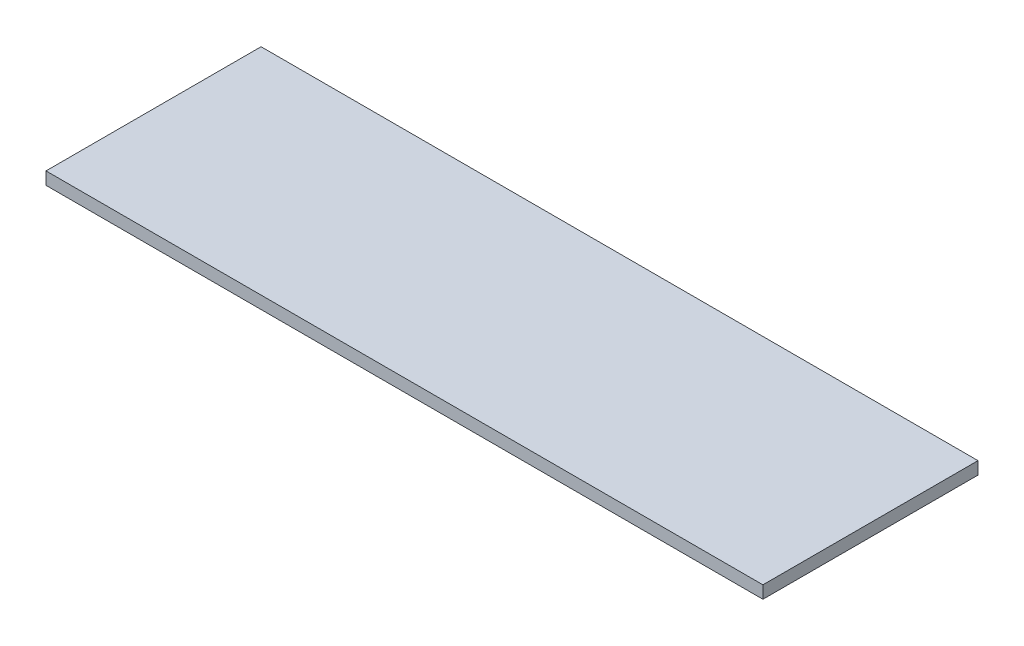
ISO-10303-21;
HEADER;
FILE_DESCRIPTION(('STEP AP214'),'2;1');
FILE_NAME('part.step','',(''),(''),'','','');
FILE_SCHEMA(('AUTOMOTIVE_DESIGN { 1 0 10303 214 1 1 1 1 }'));
ENDSEC;
DATA;
#1=APPLICATION_CONTEXT('core data for automotive mechanical design processes');
#2=APPLICATION_PROTOCOL_DEFINITION('international standard','automotive_design',2000,#1);
#3=PRODUCT_CONTEXT('',#1,'mechanical');
#4=PRODUCT('Part','Part','',(#3));
#5=PRODUCT_RELATED_PRODUCT_CATEGORY('part','',(#4));
#6=PRODUCT_DEFINITION_FORMATION('','',#4);
#7=PRODUCT_DEFINITION_CONTEXT('part definition',#1,'design');
#8=PRODUCT_DEFINITION('design','',#6,#7);
#9=PRODUCT_DEFINITION_SHAPE('','',#8);
#10=(LENGTH_UNIT() NAMED_UNIT(*) SI_UNIT(.MILLI.,.METRE.));
#11=(NAMED_UNIT(*) PLANE_ANGLE_UNIT() SI_UNIT($,.RADIAN.));
#12=(NAMED_UNIT(*) SI_UNIT($,.STERADIAN.) SOLID_ANGLE_UNIT());
#13=UNCERTAINTY_MEASURE_WITH_UNIT(LENGTH_MEASURE(1.E-05),#10,'distance_accuracy_value','');
#14=(GEOMETRIC_REPRESENTATION_CONTEXT(3) GLOBAL_UNCERTAINTY_ASSIGNED_CONTEXT((#13)) GLOBAL_UNIT_ASSIGNED_CONTEXT((#10,
#11,#12)) REPRESENTATION_CONTEXT('',''));
#15=CARTESIAN_POINT('',(0.,0.,0.));
#16=DIRECTION('',(0.,0.,1.));
#17=DIRECTION('',(1.,0.,0.));
#18=AXIS2_PLACEMENT_3D('',#15,#16,#17);
#19=CARTESIAN_POINT('',(1006.1249067144,35.,-358.016168426969));
#20=DIRECTION('',(-1.,0.,0.));
#21=DIRECTION('',(0.,0.,1.));
#22=AXIS2_PLACEMENT_3D('',#19,#20,#21);
#23=PLANE('',#22);
#24=DIRECTION('',(0.,0.,-1.));
#25=VECTOR('',#24,1.);
#26=CARTESIAN_POINT('',(1006.1249067144,0.,-358.016168426969));
#27=LINE('',#26,#25);
#28=CARTESIAN_POINT('',(1006.1249067144,0.,241.983831573031));
#29=VERTEX_POINT('',#28);
#30=CARTESIAN_POINT('',(1006.1249067144,0.,-358.016168426969));
#31=VERTEX_POINT('',#30);
#32=EDGE_CURVE('E104',#29,#31,#27,.T.);
#33=ORIENTED_EDGE('',*,*,#32,.T.);
#34=DIRECTION('',(0.,-1.,0.));
#35=VECTOR('',#34,1.);
#36=CARTESIAN_POINT('',(1006.1249067144,35.,-358.016168426969));
#37=LINE('',#36,#35);
#38=CARTESIAN_POINT('',(1006.1249067144,35.,-358.016168426969));
#39=VERTEX_POINT('',#38);
#40=EDGE_CURVE('E11',#39,#31,#37,.T.);
#41=ORIENTED_EDGE('',*,*,#40,.F.);
#42=DIRECTION('',(0.,0.,-1.));
#43=VECTOR('',#42,1.);
#44=CARTESIAN_POINT('',(1006.1249067144,35.,-358.016168426969));
#45=LINE('',#44,#43);
#46=CARTESIAN_POINT('',(1006.1249067144,35.,241.983831573031));
#47=VERTEX_POINT('',#46);
#48=EDGE_CURVE('E92',#47,#39,#45,.T.);
#49=ORIENTED_EDGE('',*,*,#48,.F.);
#50=DIRECTION('',(0.,-1.,0.));
#51=VECTOR('',#50,1.);
#52=CARTESIAN_POINT('',(1006.1249067144,35.,241.983831573031));
#53=LINE('',#52,#51);
#54=EDGE_CURVE('E100',#47,#29,#53,.T.);
#55=ORIENTED_EDGE('',*,*,#54,.T.);
#56=EDGE_LOOP('',(#33,#41,#49,#55));
#57=FACE_BOUND('',#56,.T.);
#58=ADVANCED_FACE('F41',(#57),#23,.F.);
#59=CARTESIAN_POINT('',(-993.875093285596,35.,-358.016168426969));
#60=DIRECTION('',(0.,0.,1.));
#61=DIRECTION('',(1.,0.,0.));
#62=AXIS2_PLACEMENT_3D('',#59,#60,#61);
#63=PLANE('',#62);
#64=DIRECTION('',(-1.,0.,0.));
#65=VECTOR('',#64,1.);
#66=CARTESIAN_POINT('',(-993.875093285596,0.,-358.016168426969));
#67=LINE('',#66,#65);
#68=CARTESIAN_POINT('',(-993.875093285596,0.,-358.016168426969));
#69=VERTEX_POINT('',#68);
#70=EDGE_CURVE('E96',#31,#69,#67,.T.);
#71=ORIENTED_EDGE('',*,*,#70,.T.);
#72=DIRECTION('',(0.,-1.,0.));
#73=VECTOR('',#72,1.);
#74=CARTESIAN_POINT('',(-993.875093285596,35.,-358.016168426969));
#75=LINE('',#74,#73);
#76=CARTESIAN_POINT('',(-993.875093285596,35.,-358.016168426969));
#77=VERTEX_POINT('',#76);
#78=EDGE_CURVE('E49',#77,#69,#75,.T.);
#79=ORIENTED_EDGE('',*,*,#78,.F.);
#80=DIRECTION('',(-1.,0.,0.));
#81=VECTOR('',#80,1.);
#82=CARTESIAN_POINT('',(-993.875093285596,35.,-358.016168426969));
#83=LINE('',#82,#81);
#84=EDGE_CURVE('E87',#39,#77,#83,.T.);
#85=ORIENTED_EDGE('',*,*,#84,.F.);
#86=ORIENTED_EDGE('',*,*,#40,.T.);
#87=EDGE_LOOP('',(#71,#79,#85,#86));
#88=FACE_BOUND('',#87,.T.);
#89=ADVANCED_FACE('F95',(#88),#63,.F.);
#90=CARTESIAN_POINT('',(-993.875093285596,35.,-358.016168426969));
#91=DIRECTION('',(1.,0.,0.));
#92=DIRECTION('',(0.,0.,-1.));
#93=AXIS2_PLACEMENT_3D('',#90,#91,#92);
#94=PLANE('',#93);
#95=DIRECTION('',(0.,0.,1.));
#96=VECTOR('',#95,1.);
#97=CARTESIAN_POINT('',(-993.875093285596,0.,-358.016168426969));
#98=LINE('',#97,#96);
#99=CARTESIAN_POINT('',(-993.875093285596,0.,241.983831573031));
#100=VERTEX_POINT('',#99);
#101=EDGE_CURVE('E74',#69,#100,#98,.T.);
#102=ORIENTED_EDGE('',*,*,#101,.T.);
#103=DIRECTION('',(0.,-1.,0.));
#104=VECTOR('',#103,1.);
#105=CARTESIAN_POINT('',(-993.875093285596,35.,241.983831573031));
#106=LINE('',#105,#104);
#107=CARTESIAN_POINT('',(-993.875093285596,35.,241.983831573031));
#108=VERTEX_POINT('',#107);
#109=EDGE_CURVE('E97',#108,#100,#106,.T.);
#110=ORIENTED_EDGE('',*,*,#109,.F.);
#111=DIRECTION('',(0.,0.,1.));
#112=VECTOR('',#111,1.);
#113=CARTESIAN_POINT('',(-993.875093285596,35.,-358.016168426969));
#114=LINE('',#113,#112);
#115=EDGE_CURVE('E90',#77,#108,#114,.T.);
#116=ORIENTED_EDGE('',*,*,#115,.F.);
#117=ORIENTED_EDGE('',*,*,#78,.T.);
#118=EDGE_LOOP('',(#102,#110,#116,#117));
#119=FACE_BOUND('',#118,.T.);
#120=ADVANCED_FACE('F98',(#119),#94,.F.);
#121=CARTESIAN_POINT('',(-993.875093285596,35.,241.983831573031));
#122=DIRECTION('',(0.,0.,-1.));
#123=DIRECTION('',(-1.,0.,0.));
#124=AXIS2_PLACEMENT_3D('',#121,#122,#123);
#125=PLANE('',#124);
#126=DIRECTION('',(1.,0.,0.));
#127=VECTOR('',#126,1.);
#128=CARTESIAN_POINT('',(-993.875093285596,0.,241.983831573031));
#129=LINE('',#128,#127);
#130=EDGE_CURVE('E80',#100,#29,#129,.T.);
#131=ORIENTED_EDGE('',*,*,#130,.T.);
#132=ORIENTED_EDGE('',*,*,#54,.F.);
#133=DIRECTION('',(1.,0.,0.));
#134=VECTOR('',#133,1.);
#135=CARTESIAN_POINT('',(-993.875093285596,35.,241.983831573031));
#136=LINE('',#135,#134);
#137=EDGE_CURVE('E57',#108,#47,#136,.T.);
#138=ORIENTED_EDGE('',*,*,#137,.F.);
#139=ORIENTED_EDGE('',*,*,#109,.T.);
#140=EDGE_LOOP('',(#131,#132,#138,#139));
#141=FACE_BOUND('',#140,.T.);
#142=ADVANCED_FACE('F111',(#141),#125,.F.);
#143=CARTESIAN_POINT('',(0.,35.,0.));
#144=DIRECTION('',(0.,1.,0.));
#145=DIRECTION('',(0.,0.,1.));
#146=AXIS2_PLACEMENT_3D('',#143,#144,#145);
#147=PLANE('',#146);
#148=ORIENTED_EDGE('',*,*,#48,.T.);
#149=ORIENTED_EDGE('',*,*,#84,.T.);
#150=ORIENTED_EDGE('',*,*,#115,.T.);
#151=ORIENTED_EDGE('',*,*,#137,.T.);
#152=EDGE_LOOP('',(#148,#149,#150,#151));
#153=FACE_BOUND('',#152,.T.);
#154=ADVANCED_FACE('F88',(#153),#147,.T.);
#155=CARTESIAN_POINT('',(0.,0.,0.));
#156=DIRECTION('',(0.,1.,0.));
#157=DIRECTION('',(0.,0.,1.));
#158=AXIS2_PLACEMENT_3D('',#155,#156,#157);
#159=PLANE('',#158);
#160=ORIENTED_EDGE('',*,*,#32,.F.);
#161=ORIENTED_EDGE('',*,*,#130,.F.);
#162=ORIENTED_EDGE('',*,*,#101,.F.);
#163=ORIENTED_EDGE('',*,*,#70,.F.);
#164=EDGE_LOOP('',(#160,#161,#162,#163));
#165=FACE_BOUND('',#164,.T.);
#166=ADVANCED_FACE('F114',(#165),#159,.F.);
#167=CLOSED_SHELL('',(#58,#89,#120,#142,#154,#166));
#168=MANIFOLD_SOLID_BREP('B2',#167);
#169=ADVANCED_BREP_SHAPE_REPRESENTATION('',(#18,#168),#14);
#170=SHAPE_DEFINITION_REPRESENTATION(#9,#169);
ENDSEC;
END-ISO-10303-21;
